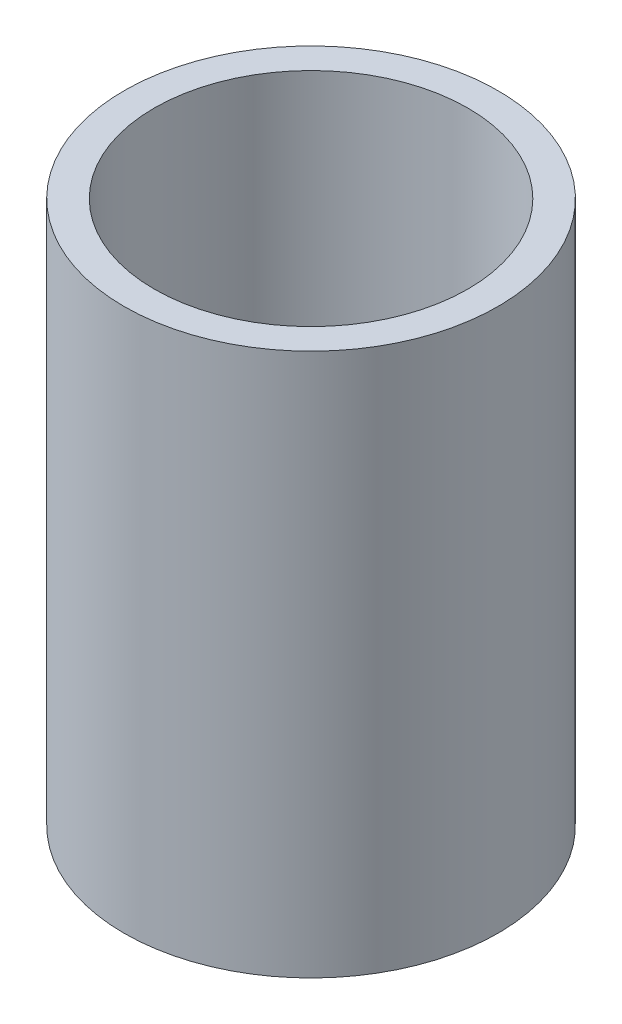
ISO-10303-21;
HEADER;
FILE_DESCRIPTION(('STEP AP214'),'2;1');
FILE_NAME('part.step','',(''),(''),'','','');
FILE_SCHEMA(('AUTOMOTIVE_DESIGN { 1 0 10303 214 1 1 1 1 }'));
ENDSEC;
DATA;
#1=APPLICATION_CONTEXT('core data for automotive mechanical design processes');
#2=APPLICATION_PROTOCOL_DEFINITION('international standard','automotive_design',2000,#1);
#3=PRODUCT_CONTEXT('',#1,'mechanical');
#4=PRODUCT('Part','Part','',(#3));
#5=PRODUCT_RELATED_PRODUCT_CATEGORY('part','',(#4));
#6=PRODUCT_DEFINITION_FORMATION('','',#4);
#7=PRODUCT_DEFINITION_CONTEXT('part definition',#1,'design');
#8=PRODUCT_DEFINITION('design','',#6,#7);
#9=PRODUCT_DEFINITION_SHAPE('','',#8);
#10=(LENGTH_UNIT() NAMED_UNIT(*) SI_UNIT(.MILLI.,.METRE.));
#11=(NAMED_UNIT(*) PLANE_ANGLE_UNIT() SI_UNIT($,.RADIAN.));
#12=(NAMED_UNIT(*) SI_UNIT($,.STERADIAN.) SOLID_ANGLE_UNIT());
#13=UNCERTAINTY_MEASURE_WITH_UNIT(LENGTH_MEASURE(1.E-05),#10,'distance_accuracy_value','');
#14=(GEOMETRIC_REPRESENTATION_CONTEXT(3) GLOBAL_UNCERTAINTY_ASSIGNED_CONTEXT((#13)) GLOBAL_UNIT_ASSIGNED_CONTEXT((#10,
#11,#12)) REPRESENTATION_CONTEXT('',''));
#15=CARTESIAN_POINT('',(0.,0.,0.));
#16=DIRECTION('',(0.,0.,1.));
#17=DIRECTION('',(1.,0.,0.));
#18=AXIS2_PLACEMENT_3D('',#15,#16,#17);
#19=CARTESIAN_POINT('',(0.,101.633148003581,0.));
#20=DIRECTION('',(0.,-1.,0.));
#21=DIRECTION('',(0.,0.,-1.));
#22=AXIS2_PLACEMENT_3D('',#19,#20,#21);
#23=CYLINDRICAL_SURFACE('',#22,35.);
#24=CARTESIAN_POINT('',(0.,101.633148003581,0.));
#25=DIRECTION('',(0.,1.,0.));
#26=DIRECTION('',(0.,0.,1.));
#27=AXIS2_PLACEMENT_3D('',#24,#25,#26);
#28=CIRCLE('',#27,35.);
#29=CARTESIAN_POINT('',(0.,101.633148003581,35.));
#30=VERTEX_POINT('',#29);
#31=EDGE_CURVE('E10',#30,#30,#28,.T.);
#32=ORIENTED_EDGE('',*,*,#31,.F.);
#33=EDGE_LOOP('',(#32));
#34=FACE_BOUND('',#33,.T.);
#35=CARTESIAN_POINT('',(0.,0.,0.));
#36=DIRECTION('',(0.,1.,0.));
#37=DIRECTION('',(0.,0.,1.));
#38=AXIS2_PLACEMENT_3D('',#35,#36,#37);
#39=CIRCLE('',#38,35.);
#40=CARTESIAN_POINT('',(0.,0.,35.));
#41=VERTEX_POINT('',#40);
#42=EDGE_CURVE('E37',#41,#41,#39,.T.);
#43=ORIENTED_EDGE('',*,*,#42,.T.);
#44=EDGE_LOOP('',(#43));
#45=FACE_BOUND('',#44,.T.);
#46=ADVANCED_FACE('F40',(#34,#45),#23,.T.);
#47=CARTESIAN_POINT('',(0.,101.633148003581,0.));
#48=DIRECTION('',(0.,1.,0.));
#49=DIRECTION('',(0.,0.,1.));
#50=AXIS2_PLACEMENT_3D('',#47,#48,#49);
#51=PLANE('',#50);
#52=CARTESIAN_POINT('',(0.,101.633148003581,0.));
#53=DIRECTION('',(0.,1.,0.));
#54=DIRECTION('',(0.,0.,1.));
#55=AXIS2_PLACEMENT_3D('',#52,#53,#54);
#56=CIRCLE('',#55,29.3630539186909);
#57=CARTESIAN_POINT('',(0.,101.633148003581,29.3630539186909));
#58=VERTEX_POINT('',#57);
#59=EDGE_CURVE('E50',#58,#58,#56,.T.);
#60=ORIENTED_EDGE('',*,*,#59,.F.);
#61=EDGE_LOOP('',(#60));
#62=FACE_BOUND('',#61,.T.);
#63=ORIENTED_EDGE('',*,*,#31,.T.);
#64=EDGE_LOOP('',(#63));
#65=FACE_BOUND('',#64,.T.);
#66=ADVANCED_FACE('F59',(#62,#65),#51,.T.);
#67=CARTESIAN_POINT('',(0.,0.,0.));
#68=DIRECTION('',(0.,1.,0.));
#69=DIRECTION('',(0.,0.,1.));
#70=AXIS2_PLACEMENT_3D('',#67,#68,#69);
#71=PLANE('',#70);
#72=CARTESIAN_POINT('',(0.,0.,0.));
#73=DIRECTION('',(0.,1.,0.));
#74=DIRECTION('',(0.,0.,1.));
#75=AXIS2_PLACEMENT_3D('',#72,#73,#74);
#76=CIRCLE('',#75,29.3630539186909);
#77=CARTESIAN_POINT('',(0.,0.,29.3630539186909));
#78=VERTEX_POINT('',#77);
#79=EDGE_CURVE('E47',#78,#78,#76,.T.);
#80=ORIENTED_EDGE('',*,*,#79,.T.);
#81=EDGE_LOOP('',(#80));
#82=FACE_BOUND('',#81,.T.);
#83=ORIENTED_EDGE('',*,*,#42,.F.);
#84=EDGE_LOOP('',(#83));
#85=FACE_BOUND('',#84,.T.);
#86=ADVANCED_FACE('F58',(#82,#85),#71,.F.);
#87=CARTESIAN_POINT('',(0.,101.633148003581,0.));
#88=DIRECTION('',(0.,-1.,0.));
#89=DIRECTION('',(0.,0.,-1.));
#90=AXIS2_PLACEMENT_3D('',#87,#88,#89);
#91=CYLINDRICAL_SURFACE('',#90,29.3630539186909);
#92=ORIENTED_EDGE('',*,*,#59,.T.);
#93=EDGE_LOOP('',(#92));
#94=FACE_BOUND('',#93,.T.);
#95=ORIENTED_EDGE('',*,*,#79,.F.);
#96=EDGE_LOOP('',(#95));
#97=FACE_BOUND('',#96,.T.);
#98=ADVANCED_FACE('F54',(#94,#97),#91,.F.);
#99=CLOSED_SHELL('',(#46,#66,#86,#98));
#100=MANIFOLD_SOLID_BREP('B2',#99);
#101=ADVANCED_BREP_SHAPE_REPRESENTATION('',(#18,#100),#14);
#102=SHAPE_DEFINITION_REPRESENTATION(#9,#101);
ENDSEC;
END-ISO-10303-21;
